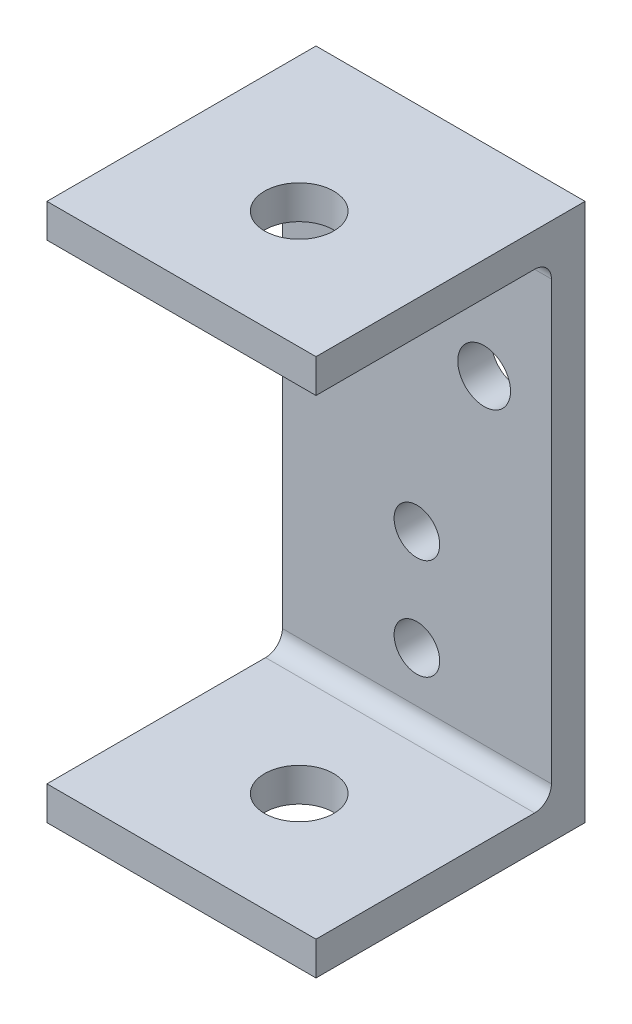
ISO-10303-21;
HEADER;
FILE_DESCRIPTION(('STEP AP214'),'2;1');
FILE_NAME('part.step','',(''),(''),'','','');
FILE_SCHEMA(('AUTOMOTIVE_DESIGN { 1 0 10303 214 1 1 1 1 }'));
ENDSEC;
DATA;
#1=APPLICATION_CONTEXT('core data for automotive mechanical design processes');
#2=APPLICATION_PROTOCOL_DEFINITION('international standard','automotive_design',2000,#1);
#3=PRODUCT_CONTEXT('',#1,'mechanical');
#4=PRODUCT('Part','Part','',(#3));
#5=PRODUCT_RELATED_PRODUCT_CATEGORY('part','',(#4));
#6=PRODUCT_DEFINITION_FORMATION('','',#4);
#7=PRODUCT_DEFINITION_CONTEXT('part definition',#1,'design');
#8=PRODUCT_DEFINITION('design','',#6,#7);
#9=PRODUCT_DEFINITION_SHAPE('','',#8);
#10=(LENGTH_UNIT() NAMED_UNIT(*) SI_UNIT(.MILLI.,.METRE.));
#11=(NAMED_UNIT(*) PLANE_ANGLE_UNIT() SI_UNIT($,.RADIAN.));
#12=(NAMED_UNIT(*) SI_UNIT($,.STERADIAN.) SOLID_ANGLE_UNIT());
#13=UNCERTAINTY_MEASURE_WITH_UNIT(LENGTH_MEASURE(1.E-05),#10,'distance_accuracy_value','');
#14=(GEOMETRIC_REPRESENTATION_CONTEXT(3) GLOBAL_UNCERTAINTY_ASSIGNED_CONTEXT((#13)) GLOBAL_UNIT_ASSIGNED_CONTEXT((#10,
#11,#12)) REPRESENTATION_CONTEXT('',''));
#15=CARTESIAN_POINT('',(0.,0.,0.));
#16=DIRECTION('',(0.,0.,1.));
#17=DIRECTION('',(1.,0.,0.));
#18=AXIS2_PLACEMENT_3D('',#15,#16,#17);
#19=CARTESIAN_POINT('',(12.7,-50.8,14.2875));
#20=DIRECTION('',(0.,1.,0.));
#21=DIRECTION('',(0.,0.,1.));
#22=AXIS2_PLACEMENT_3D('',#19,#20,#21);
#23=CYLINDRICAL_SURFACE('',#22,3.2639);
#24=CARTESIAN_POINT('',(12.7,-50.8,14.2875));
#25=DIRECTION('',(0.,1.,0.));
#26=DIRECTION('',(0.,0.,1.));
#27=AXIS2_PLACEMENT_3D('',#24,#25,#26);
#28=CIRCLE('',#27,3.2639);
#29=CARTESIAN_POINT('',(12.7,-50.8,17.5514));
#30=VERTEX_POINT('',#29);
#31=EDGE_CURVE('E97',#30,#30,#28,.T.);
#32=ORIENTED_EDGE('',*,*,#31,.F.);
#33=EDGE_LOOP('',(#32));
#34=FACE_BOUND('',#33,.T.);
#35=CARTESIAN_POINT('',(12.7,-47.625,14.2875));
#36=DIRECTION('',(0.,1.,0.));
#37=DIRECTION('',(0.,0.,1.));
#38=AXIS2_PLACEMENT_3D('',#35,#36,#37);
#39=CIRCLE('',#38,3.2639);
#40=CARTESIAN_POINT('',(12.7,-47.625,17.5514));
#41=VERTEX_POINT('',#40);
#42=EDGE_CURVE('E20',#41,#41,#39,.F.);
#43=ORIENTED_EDGE('',*,*,#42,.F.);
#44=EDGE_LOOP('',(#43));
#45=FACE_BOUND('',#44,.T.);
#46=ADVANCED_FACE('F17',(#34,#45),#23,.F.);
#47=CARTESIAN_POINT('',(12.7,-50.8,14.2875));
#48=DIRECTION('',(0.,1.,0.));
#49=DIRECTION('',(0.,0.,1.));
#50=AXIS2_PLACEMENT_3D('',#47,#48,#49);
#51=CYLINDRICAL_SURFACE('',#50,3.2639);
#52=CARTESIAN_POINT('',(12.7,0.,14.2875));
#53=DIRECTION('',(0.,1.,0.));
#54=DIRECTION('',(0.,0.,1.));
#55=AXIS2_PLACEMENT_3D('',#52,#53,#54);
#56=CIRCLE('',#55,3.2639);
#57=CARTESIAN_POINT('',(12.7,0.,17.5514));
#58=VERTEX_POINT('',#57);
#59=EDGE_CURVE('E141',#58,#58,#56,.F.);
#60=ORIENTED_EDGE('',*,*,#59,.F.);
#61=EDGE_LOOP('',(#60));
#62=FACE_BOUND('',#61,.T.);
#63=CARTESIAN_POINT('',(12.7,-3.175,14.2875));
#64=DIRECTION('',(0.,1.,0.));
#65=DIRECTION('',(0.,0.,1.));
#66=AXIS2_PLACEMENT_3D('',#63,#64,#65);
#67=CIRCLE('',#66,3.2639);
#68=CARTESIAN_POINT('',(12.7,-3.175,17.5514));
#69=VERTEX_POINT('',#68);
#70=EDGE_CURVE('E122',#69,#69,#67,.T.);
#71=ORIENTED_EDGE('',*,*,#70,.F.);
#72=EDGE_LOOP('',(#71));
#73=FACE_BOUND('',#72,.T.);
#74=ADVANCED_FACE('F224',(#62,#73),#51,.F.);
#75=CARTESIAN_POINT('',(12.7,-4.7625,4.7625));
#76=DIRECTION('',(1.,0.,0.));
#77=DIRECTION('',(0.,0.,-1.));
#78=AXIS2_PLACEMENT_3D('',#75,#76,#77);
#79=CYLINDRICAL_SURFACE('',#78,1.5875);
#80=CARTESIAN_POINT('',(25.4,-4.7625,4.7625));
#81=DIRECTION('',(1.,0.,0.));
#82=DIRECTION('',(0.,0.,-1.));
#83=AXIS2_PLACEMENT_3D('',#80,#81,#82);
#84=CIRCLE('',#83,1.5875);
#85=CARTESIAN_POINT('',(25.4,-3.175,4.7625));
#86=VERTEX_POINT('',#85);
#87=CARTESIAN_POINT('',(25.4,-4.7625,3.175));
#88=VERTEX_POINT('',#87);
#89=EDGE_CURVE('E213',#86,#88,#84,.F.);
#90=ORIENTED_EDGE('',*,*,#89,.F.);
#91=DIRECTION('',(1.,0.,0.));
#92=VECTOR('',#91,1.);
#93=CARTESIAN_POINT('',(0.,-3.175,4.7625));
#94=LINE('',#93,#92);
#95=CARTESIAN_POINT('',(0.,-3.175,4.7625));
#96=VERTEX_POINT('',#95);
#97=EDGE_CURVE('E85',#96,#86,#94,.T.);
#98=ORIENTED_EDGE('',*,*,#97,.F.);
#99=CARTESIAN_POINT('',(0.,-4.7625,4.7625));
#100=DIRECTION('',(1.,0.,0.));
#101=DIRECTION('',(0.,0.,-1.));
#102=AXIS2_PLACEMENT_3D('',#99,#100,#101);
#103=CIRCLE('',#102,1.5875);
#104=CARTESIAN_POINT('',(0.,-4.7625,3.175));
#105=VERTEX_POINT('',#104);
#106=EDGE_CURVE('E88',#96,#105,#103,.F.);
#107=ORIENTED_EDGE('',*,*,#106,.T.);
#108=DIRECTION('',(1.,0.,0.));
#109=VECTOR('',#108,1.);
#110=CARTESIAN_POINT('',(0.,-4.7625,3.175));
#111=LINE('',#110,#109);
#112=EDGE_CURVE('E91',#88,#105,#111,.F.);
#113=ORIENTED_EDGE('',*,*,#112,.F.);
#114=EDGE_LOOP('',(#90,#98,#107,#113));
#115=FACE_BOUND('',#114,.T.);
#116=ADVANCED_FACE('F90',(#115),#79,.F.);
#117=CARTESIAN_POINT('',(12.7,-46.0375,4.7625));
#118=DIRECTION('',(1.,0.,0.));
#119=DIRECTION('',(0.,0.,-1.));
#120=AXIS2_PLACEMENT_3D('',#117,#118,#119);
#121=CYLINDRICAL_SURFACE('',#120,1.5875);
#122=CARTESIAN_POINT('',(25.4,-46.0375,4.7625));
#123=DIRECTION('',(1.,0.,0.));
#124=DIRECTION('',(0.,0.,-1.));
#125=AXIS2_PLACEMENT_3D('',#122,#123,#124);
#126=CIRCLE('',#125,1.5875);
#127=CARTESIAN_POINT('',(25.4,-46.0375,3.175));
#128=VERTEX_POINT('',#127);
#129=CARTESIAN_POINT('',(25.4,-47.625,4.7625));
#130=VERTEX_POINT('',#129);
#131=EDGE_CURVE('E210',#128,#130,#126,.F.);
#132=ORIENTED_EDGE('',*,*,#131,.F.);
#133=DIRECTION('',(1.,0.,0.));
#134=VECTOR('',#133,1.);
#135=CARTESIAN_POINT('',(0.,-46.0375,3.175));
#136=LINE('',#135,#134);
#137=CARTESIAN_POINT('',(0.,-46.0375,3.175));
#138=VERTEX_POINT('',#137);
#139=EDGE_CURVE('E107',#138,#128,#136,.T.);
#140=ORIENTED_EDGE('',*,*,#139,.F.);
#141=CARTESIAN_POINT('',(0.,-46.0375,4.7625));
#142=DIRECTION('',(1.,0.,0.));
#143=DIRECTION('',(0.,0.,-1.));
#144=AXIS2_PLACEMENT_3D('',#141,#142,#143);
#145=CIRCLE('',#144,1.5875);
#146=CARTESIAN_POINT('',(0.,-47.625,4.7625));
#147=VERTEX_POINT('',#146);
#148=EDGE_CURVE('E111',#138,#147,#145,.F.);
#149=ORIENTED_EDGE('',*,*,#148,.T.);
#150=DIRECTION('',(1.,0.,0.));
#151=VECTOR('',#150,1.);
#152=CARTESIAN_POINT('',(0.,-47.625,4.7625));
#153=LINE('',#152,#151);
#154=EDGE_CURVE('E157',#130,#147,#153,.F.);
#155=ORIENTED_EDGE('',*,*,#154,.F.);
#156=EDGE_LOOP('',(#132,#140,#149,#155));
#157=FACE_BOUND('',#156,.T.);
#158=ADVANCED_FACE('F232',(#157),#121,.F.);
#159=CARTESIAN_POINT('',(0.,-47.625,3.175));
#160=DIRECTION('',(0.,1.,0.));
#161=DIRECTION('',(0.,0.,1.));
#162=AXIS2_PLACEMENT_3D('',#159,#160,#161);
#163=PLANE('',#162);
#164=ORIENTED_EDGE('',*,*,#42,.T.);
#165=EDGE_LOOP('',(#164));
#166=FACE_BOUND('',#165,.T.);
#167=DIRECTION('',(0.,0.,-1.));
#168=VECTOR('',#167,1.);
#169=CARTESIAN_POINT('',(25.4,-47.625,0.));
#170=LINE('',#169,#168);
#171=CARTESIAN_POINT('',(25.4,-47.625,25.4));
#172=VERTEX_POINT('',#171);
#173=EDGE_CURVE('E163',#130,#172,#170,.F.);
#174=ORIENTED_EDGE('',*,*,#173,.F.);
#175=ORIENTED_EDGE('',*,*,#154,.T.);
#176=DIRECTION('',(0.,0.,-1.));
#177=VECTOR('',#176,1.);
#178=CARTESIAN_POINT('',(0.,-47.625,0.));
#179=LINE('',#178,#177);
#180=CARTESIAN_POINT('',(0.,-47.625,25.4));
#181=VERTEX_POINT('',#180);
#182=EDGE_CURVE('E113',#147,#181,#179,.F.);
#183=ORIENTED_EDGE('',*,*,#182,.T.);
#184=DIRECTION('',(1.,0.,0.));
#185=VECTOR('',#184,1.);
#186=CARTESIAN_POINT('',(0.,-47.625,25.4));
#187=LINE('',#186,#185);
#188=EDGE_CURVE('E126',#172,#181,#187,.F.);
#189=ORIENTED_EDGE('',*,*,#188,.F.);
#190=EDGE_LOOP('',(#174,#175,#183,#189));
#191=FACE_BOUND('',#190,.T.);
#192=ADVANCED_FACE('F286',(#166,#191),#163,.T.);
#193=CARTESIAN_POINT('',(0.,0.,25.4));
#194=DIRECTION('',(0.,0.,1.));
#195=DIRECTION('',(1.,0.,0.));
#196=AXIS2_PLACEMENT_3D('',#193,#194,#195);
#197=PLANE('',#196);
#198=DIRECTION('',(1.,0.,0.));
#199=VECTOR('',#198,1.);
#200=CARTESIAN_POINT('',(0.,-50.8,25.4));
#201=LINE('',#200,#199);
#202=CARTESIAN_POINT('',(25.4,-50.8,25.4));
#203=VERTEX_POINT('',#202);
#204=CARTESIAN_POINT('',(0.,-50.8,25.4));
#205=VERTEX_POINT('',#204);
#206=EDGE_CURVE('E106',#203,#205,#201,.F.);
#207=ORIENTED_EDGE('',*,*,#206,.F.);
#208=DIRECTION('',(0.,1.,0.));
#209=VECTOR('',#208,1.);
#210=CARTESIAN_POINT('',(25.4,0.,25.4));
#211=LINE('',#210,#209);
#212=EDGE_CURVE('E160',#172,#203,#211,.F.);
#213=ORIENTED_EDGE('',*,*,#212,.F.);
#214=ORIENTED_EDGE('',*,*,#188,.T.);
#215=DIRECTION('',(0.,1.,0.));
#216=VECTOR('',#215,1.);
#217=CARTESIAN_POINT('',(0.,0.,25.4));
#218=LINE('',#217,#216);
#219=EDGE_CURVE('E186',#181,#205,#218,.F.);
#220=ORIENTED_EDGE('',*,*,#219,.T.);
#221=EDGE_LOOP('',(#207,#213,#214,#220));
#222=FACE_BOUND('',#221,.T.);
#223=ADVANCED_FACE('F282',(#222),#197,.T.);
#224=CARTESIAN_POINT('',(0.,0.,25.4));
#225=DIRECTION('',(0.,0.,1.));
#226=DIRECTION('',(1.,0.,0.));
#227=AXIS2_PLACEMENT_3D('',#224,#225,#226);
#228=PLANE('',#227);
#229=DIRECTION('',(1.,0.,0.));
#230=VECTOR('',#229,1.);
#231=CARTESIAN_POINT('',(0.,-3.175,25.4));
#232=LINE('',#231,#230);
#233=CARTESIAN_POINT('',(25.4,-3.175,25.4));
#234=VERTEX_POINT('',#233);
#235=CARTESIAN_POINT('',(0.,-3.175,25.4));
#236=VERTEX_POINT('',#235);
#237=EDGE_CURVE('E123',#234,#236,#232,.F.);
#238=ORIENTED_EDGE('',*,*,#237,.F.);
#239=DIRECTION('',(0.,1.,0.));
#240=VECTOR('',#239,1.);
#241=CARTESIAN_POINT('',(25.4,0.,25.4));
#242=LINE('',#241,#240);
#243=CARTESIAN_POINT('',(25.4,0.,25.4));
#244=VERTEX_POINT('',#243);
#245=EDGE_CURVE('E129',#244,#234,#242,.F.);
#246=ORIENTED_EDGE('',*,*,#245,.F.);
#247=DIRECTION('',(1.,0.,0.));
#248=VECTOR('',#247,1.);
#249=CARTESIAN_POINT('',(0.,0.,25.4));
#250=LINE('',#249,#248);
#251=CARTESIAN_POINT('',(0.,0.,25.4));
#252=VERTEX_POINT('',#251);
#253=EDGE_CURVE('E139',#252,#244,#250,.T.);
#254=ORIENTED_EDGE('',*,*,#253,.F.);
#255=DIRECTION('',(0.,1.,0.));
#256=VECTOR('',#255,1.);
#257=CARTESIAN_POINT('',(0.,0.,25.4));
#258=LINE('',#257,#256);
#259=EDGE_CURVE('E176',#252,#236,#258,.F.);
#260=ORIENTED_EDGE('',*,*,#259,.T.);
#261=EDGE_LOOP('',(#238,#246,#254,#260));
#262=FACE_BOUND('',#261,.T.);
#263=ADVANCED_FACE('F279',(#262),#228,.T.);
#264=CARTESIAN_POINT('',(0.,-3.175,25.4));
#265=DIRECTION('',(0.,-1.,0.));
#266=DIRECTION('',(0.,0.,-1.));
#267=AXIS2_PLACEMENT_3D('',#264,#265,#266);
#268=PLANE('',#267);
#269=ORIENTED_EDGE('',*,*,#70,.T.);
#270=EDGE_LOOP('',(#269));
#271=FACE_BOUND('',#270,.T.);
#272=DIRECTION('',(0.,0.,-1.));
#273=VECTOR('',#272,1.);
#274=CARTESIAN_POINT('',(0.,-3.175,0.));
#275=LINE('',#274,#273);
#276=EDGE_CURVE('E173',#236,#96,#275,.T.);
#277=ORIENTED_EDGE('',*,*,#276,.T.);
#278=ORIENTED_EDGE('',*,*,#97,.T.);
#279=DIRECTION('',(0.,0.,-1.));
#280=VECTOR('',#279,1.);
#281=CARTESIAN_POINT('',(25.4,-3.175,0.));
#282=LINE('',#281,#280);
#283=EDGE_CURVE('E132',#234,#86,#282,.T.);
#284=ORIENTED_EDGE('',*,*,#283,.F.);
#285=ORIENTED_EDGE('',*,*,#237,.T.);
#286=EDGE_LOOP('',(#277,#278,#284,#285));
#287=FACE_BOUND('',#286,.T.);
#288=ADVANCED_FACE('F221',(#271,#287),#268,.T.);
#289=CARTESIAN_POINT('',(0.,-3.175,3.175));
#290=DIRECTION('',(0.,0.,1.));
#291=DIRECTION('',(1.,0.,0.));
#292=AXIS2_PLACEMENT_3D('',#289,#290,#291);
#293=PLANE('',#292);
#294=CARTESIAN_POINT('',(12.7,-41.275,3.175));
#295=DIRECTION('',(0.,0.,1.));
#296=DIRECTION('',(1.,0.,0.));
#297=AXIS2_PLACEMENT_3D('',#294,#295,#296);
#298=CIRCLE('',#297,2.15265);
#299=CARTESIAN_POINT('',(14.85265,-41.275,3.175));
#300=VERTEX_POINT('',#299);
#301=EDGE_CURVE('E198',#300,#300,#298,.F.);
#302=ORIENTED_EDGE('',*,*,#301,.T.);
#303=EDGE_LOOP('',(#302));
#304=FACE_BOUND('',#303,.T.);
#305=CARTESIAN_POINT('',(12.7,-31.75,3.175));
#306=DIRECTION('',(0.,0.,1.));
#307=DIRECTION('',(1.,0.,0.));
#308=AXIS2_PLACEMENT_3D('',#305,#306,#307);
#309=CIRCLE('',#308,2.15265);
#310=CARTESIAN_POINT('',(14.85265,-31.75,3.175));
#311=VERTEX_POINT('',#310);
#312=EDGE_CURVE('E201',#311,#311,#309,.F.);
#313=ORIENTED_EDGE('',*,*,#312,.T.);
#314=EDGE_LOOP('',(#313));
#315=FACE_BOUND('',#314,.T.);
#316=CARTESIAN_POINT('',(19.05,-15.875,3.175));
#317=DIRECTION('',(0.,0.,1.));
#318=DIRECTION('',(1.,0.,0.));
#319=AXIS2_PLACEMENT_3D('',#316,#317,#318);
#320=CIRCLE('',#319,2.4892);
#321=CARTESIAN_POINT('',(21.5392,-15.875,3.175));
#322=VERTEX_POINT('',#321);
#323=EDGE_CURVE('E204',#322,#322,#320,.F.);
#324=ORIENTED_EDGE('',*,*,#323,.T.);
#325=EDGE_LOOP('',(#324));
#326=FACE_BOUND('',#325,.T.);
#327=CARTESIAN_POINT('',(6.35,-15.875,3.175));
#328=DIRECTION('',(0.,0.,1.));
#329=DIRECTION('',(1.,0.,0.));
#330=AXIS2_PLACEMENT_3D('',#327,#328,#329);
#331=CIRCLE('',#330,2.4892);
#332=CARTESIAN_POINT('',(8.8392,-15.875,3.175));
#333=VERTEX_POINT('',#332);
#334=EDGE_CURVE('E207',#333,#333,#331,.F.);
#335=ORIENTED_EDGE('',*,*,#334,.T.);
#336=EDGE_LOOP('',(#335));
#337=FACE_BOUND('',#336,.T.);
#338=DIRECTION('',(0.,1.,0.));
#339=VECTOR('',#338,1.);
#340=CARTESIAN_POINT('',(25.4,0.,3.175));
#341=LINE('',#340,#339);
#342=EDGE_CURVE('E104',#88,#128,#341,.F.);
#343=ORIENTED_EDGE('',*,*,#342,.F.);
#344=ORIENTED_EDGE('',*,*,#112,.T.);
#345=DIRECTION('',(0.,1.,0.));
#346=VECTOR('',#345,1.);
#347=CARTESIAN_POINT('',(0.,0.,3.175));
#348=LINE('',#347,#346);
#349=EDGE_CURVE('E96',#105,#138,#348,.F.);
#350=ORIENTED_EDGE('',*,*,#349,.T.);
#351=ORIENTED_EDGE('',*,*,#139,.T.);
#352=EDGE_LOOP('',(#343,#344,#350,#351));
#353=FACE_BOUND('',#352,.T.);
#354=ADVANCED_FACE('F101',(#304,#315,#326,#337,#353),#293,.T.);
#355=CARTESIAN_POINT('',(0.,-50.8,25.4));
#356=DIRECTION('',(0.,-1.,0.));
#357=DIRECTION('',(0.,0.,-1.));
#358=AXIS2_PLACEMENT_3D('',#355,#356,#357);
#359=PLANE('',#358);
#360=ORIENTED_EDGE('',*,*,#31,.T.);
#361=EDGE_LOOP('',(#360));
#362=FACE_BOUND('',#361,.T.);
#363=DIRECTION('',(-1.,0.,0.));
#364=VECTOR('',#363,1.);
#365=CARTESIAN_POINT('',(0.,-50.8,0.));
#366=LINE('',#365,#364);
#367=CARTESIAN_POINT('',(25.4,-50.8,0.));
#368=VERTEX_POINT('',#367);
#369=CARTESIAN_POINT('',(0.,-50.8,0.));
#370=VERTEX_POINT('',#369);
#371=EDGE_CURVE('E183',#368,#370,#366,.T.);
#372=ORIENTED_EDGE('',*,*,#371,.F.);
#373=DIRECTION('',(0.,0.,-1.));
#374=VECTOR('',#373,1.);
#375=CARTESIAN_POINT('',(25.4,-50.8,0.));
#376=LINE('',#375,#374);
#377=EDGE_CURVE('E136',#203,#368,#376,.T.);
#378=ORIENTED_EDGE('',*,*,#377,.F.);
#379=ORIENTED_EDGE('',*,*,#206,.T.);
#380=DIRECTION('',(0.,0.,-1.));
#381=VECTOR('',#380,1.);
#382=CARTESIAN_POINT('',(0.,-50.8,0.));
#383=LINE('',#382,#381);
#384=EDGE_CURVE('E178',#205,#370,#383,.T.);
#385=ORIENTED_EDGE('',*,*,#384,.T.);
#386=EDGE_LOOP('',(#372,#378,#379,#385));
#387=FACE_BOUND('',#386,.T.);
#388=ADVANCED_FACE('F270',(#362,#387),#359,.T.);
#389=CARTESIAN_POINT('',(0.,0.,0.));
#390=DIRECTION('',(1.,0.,0.));
#391=DIRECTION('',(0.,0.,-1.));
#392=AXIS2_PLACEMENT_3D('',#389,#390,#391);
#393=PLANE('',#392);
#394=ORIENTED_EDGE('',*,*,#259,.F.);
#395=DIRECTION('',(0.,0.,1.));
#396=VECTOR('',#395,1.);
#397=CARTESIAN_POINT('',(0.,0.,0.));
#398=LINE('',#397,#396);
#399=CARTESIAN_POINT('',(0.,0.,0.));
#400=VERTEX_POINT('',#399);
#401=EDGE_CURVE('E142',#400,#252,#398,.T.);
#402=ORIENTED_EDGE('',*,*,#401,.F.);
#403=DIRECTION('',(0.,1.,0.));
#404=VECTOR('',#403,1.);
#405=CARTESIAN_POINT('',(0.,-50.8,0.));
#406=LINE('',#405,#404);
#407=EDGE_CURVE('E154',#370,#400,#406,.T.);
#408=ORIENTED_EDGE('',*,*,#407,.F.);
#409=ORIENTED_EDGE('',*,*,#384,.F.);
#410=ORIENTED_EDGE('',*,*,#219,.F.);
#411=ORIENTED_EDGE('',*,*,#182,.F.);
#412=ORIENTED_EDGE('',*,*,#148,.F.);
#413=ORIENTED_EDGE('',*,*,#349,.F.);
#414=ORIENTED_EDGE('',*,*,#106,.F.);
#415=ORIENTED_EDGE('',*,*,#276,.F.);
#416=EDGE_LOOP('',(#394,#402,#408,#409,#410,#411,#412,#413,#414,#415));
#417=FACE_BOUND('',#416,.T.);
#418=ADVANCED_FACE('F109',(#417),#393,.F.);
#419=CARTESIAN_POINT('',(0.,0.,0.));
#420=DIRECTION('',(0.,1.,0.));
#421=DIRECTION('',(0.,0.,1.));
#422=AXIS2_PLACEMENT_3D('',#419,#420,#421);
#423=PLANE('',#422);
#424=ORIENTED_EDGE('',*,*,#59,.T.);
#425=EDGE_LOOP('',(#424));
#426=FACE_BOUND('',#425,.T.);
#427=ORIENTED_EDGE('',*,*,#253,.T.);
#428=DIRECTION('',(0.,0.,-1.));
#429=VECTOR('',#428,1.);
#430=CARTESIAN_POINT('',(25.4,0.,0.));
#431=LINE('',#430,#429);
#432=CARTESIAN_POINT('',(25.4,0.,0.));
#433=VERTEX_POINT('',#432);
#434=EDGE_CURVE('E35',#433,#244,#431,.F.);
#435=ORIENTED_EDGE('',*,*,#434,.F.);
#436=DIRECTION('',(-1.,0.,0.));
#437=VECTOR('',#436,1.);
#438=CARTESIAN_POINT('',(0.,0.,0.));
#439=LINE('',#438,#437);
#440=EDGE_CURVE('E149',#400,#433,#439,.F.);
#441=ORIENTED_EDGE('',*,*,#440,.F.);
#442=ORIENTED_EDGE('',*,*,#401,.T.);
#443=EDGE_LOOP('',(#427,#435,#441,#442));
#444=FACE_BOUND('',#443,.T.);
#445=ADVANCED_FACE('F263',(#426,#444),#423,.T.);
#446=CARTESIAN_POINT('',(25.4,0.,0.));
#447=DIRECTION('',(1.,0.,0.));
#448=DIRECTION('',(0.,0.,-1.));
#449=AXIS2_PLACEMENT_3D('',#446,#447,#448);
#450=PLANE('',#449);
#451=ORIENTED_EDGE('',*,*,#245,.T.);
#452=ORIENTED_EDGE('',*,*,#283,.T.);
#453=ORIENTED_EDGE('',*,*,#89,.T.);
#454=ORIENTED_EDGE('',*,*,#342,.T.);
#455=ORIENTED_EDGE('',*,*,#131,.T.);
#456=ORIENTED_EDGE('',*,*,#173,.T.);
#457=ORIENTED_EDGE('',*,*,#212,.T.);
#458=ORIENTED_EDGE('',*,*,#377,.T.);
#459=DIRECTION('',(0.,1.,0.));
#460=VECTOR('',#459,1.);
#461=CARTESIAN_POINT('',(25.4,-50.8,0.));
#462=LINE('',#461,#460);
#463=EDGE_CURVE('E145',#433,#368,#462,.F.);
#464=ORIENTED_EDGE('',*,*,#463,.F.);
#465=ORIENTED_EDGE('',*,*,#434,.T.);
#466=EDGE_LOOP('',(#451,#452,#453,#454,#455,#456,#457,#458,#464,#465));
#467=FACE_BOUND('',#466,.T.);
#468=ADVANCED_FACE('F259',(#467),#450,.T.);
#469=CARTESIAN_POINT('',(6.35,-15.875,0.927499999826));
#470=DIRECTION('',(0.,0.,1.));
#471=DIRECTION('',(1.,0.,0.));
#472=AXIS2_PLACEMENT_3D('',#469,#470,#471);
#473=CYLINDRICAL_SURFACE('',#472,2.4892);
#474=ORIENTED_EDGE('',*,*,#334,.F.);
#475=EDGE_LOOP('',(#474));
#476=FACE_BOUND('',#475,.T.);
#477=CARTESIAN_POINT('',(6.35,-15.875,0.));
#478=DIRECTION('',(0.,0.,1.));
#479=DIRECTION('',(1.,0.,0.));
#480=AXIS2_PLACEMENT_3D('',#477,#478,#479);
#481=CIRCLE('',#480,2.4892);
#482=CARTESIAN_POINT('',(8.8392,-15.875,0.));
#483=VERTEX_POINT('',#482);
#484=EDGE_CURVE('E148',#483,#483,#481,.T.);
#485=ORIENTED_EDGE('',*,*,#484,.F.);
#486=EDGE_LOOP('',(#485));
#487=FACE_BOUND('',#486,.T.);
#488=ADVANCED_FACE('F255',(#476,#487),#473,.F.);
#489=CARTESIAN_POINT('',(19.05,-15.875,0.927499999826));
#490=DIRECTION('',(0.,0.,1.));
#491=DIRECTION('',(1.,0.,0.));
#492=AXIS2_PLACEMENT_3D('',#489,#490,#491);
#493=CYLINDRICAL_SURFACE('',#492,2.4892);
#494=ORIENTED_EDGE('',*,*,#323,.F.);
#495=EDGE_LOOP('',(#494));
#496=FACE_BOUND('',#495,.T.);
#497=CARTESIAN_POINT('',(19.05,-15.875,0.));
#498=DIRECTION('',(0.,0.,1.));
#499=DIRECTION('',(1.,0.,0.));
#500=AXIS2_PLACEMENT_3D('',#497,#498,#499);
#501=CIRCLE('',#500,2.4892);
#502=CARTESIAN_POINT('',(21.5392,-15.875,0.));
#503=VERTEX_POINT('',#502);
#504=EDGE_CURVE('E193',#503,#503,#501,.T.);
#505=ORIENTED_EDGE('',*,*,#504,.F.);
#506=EDGE_LOOP('',(#505));
#507=FACE_BOUND('',#506,.T.);
#508=ADVANCED_FACE('F251',(#496,#507),#493,.F.);
#509=CARTESIAN_POINT('',(12.7,-31.75,0.927499999826));
#510=DIRECTION('',(0.,0.,1.));
#511=DIRECTION('',(1.,0.,0.));
#512=AXIS2_PLACEMENT_3D('',#509,#510,#511);
#513=CYLINDRICAL_SURFACE('',#512,2.15265);
#514=ORIENTED_EDGE('',*,*,#312,.F.);
#515=EDGE_LOOP('',(#514));
#516=FACE_BOUND('',#515,.T.);
#517=CARTESIAN_POINT('',(12.7,-31.75,0.));
#518=DIRECTION('',(0.,0.,1.));
#519=DIRECTION('',(1.,0.,0.));
#520=AXIS2_PLACEMENT_3D('',#517,#518,#519);
#521=CIRCLE('',#520,2.15265);
#522=CARTESIAN_POINT('',(14.85265,-31.75,0.));
#523=VERTEX_POINT('',#522);
#524=EDGE_CURVE('E26',#523,#523,#521,.T.);
#525=ORIENTED_EDGE('',*,*,#524,.F.);
#526=EDGE_LOOP('',(#525));
#527=FACE_BOUND('',#526,.T.);
#528=ADVANCED_FACE('F244',(#516,#527),#513,.F.);
#529=CARTESIAN_POINT('',(12.7,-41.275,0.927499999826));
#530=DIRECTION('',(0.,0.,1.));
#531=DIRECTION('',(1.,0.,0.));
#532=AXIS2_PLACEMENT_3D('',#529,#530,#531);
#533=CYLINDRICAL_SURFACE('',#532,2.15265);
#534=ORIENTED_EDGE('',*,*,#301,.F.);
#535=EDGE_LOOP('',(#534));
#536=FACE_BOUND('',#535,.T.);
#537=CARTESIAN_POINT('',(12.7,-41.275,0.));
#538=DIRECTION('',(0.,0.,1.));
#539=DIRECTION('',(1.,0.,0.));
#540=AXIS2_PLACEMENT_3D('',#537,#538,#539);
#541=CIRCLE('',#540,2.15265);
#542=CARTESIAN_POINT('',(14.85265,-41.275,0.));
#543=VERTEX_POINT('',#542);
#544=EDGE_CURVE('E11',#543,#543,#541,.T.);
#545=ORIENTED_EDGE('',*,*,#544,.F.);
#546=EDGE_LOOP('',(#545));
#547=FACE_BOUND('',#546,.T.);
#548=ADVANCED_FACE('F238',(#536,#547),#533,.F.);
#549=CARTESIAN_POINT('',(0.,-50.8,0.));
#550=DIRECTION('',(0.,0.,-1.));
#551=DIRECTION('',(-1.,0.,0.));
#552=AXIS2_PLACEMENT_3D('',#549,#550,#551);
#553=PLANE('',#552);
#554=ORIENTED_EDGE('',*,*,#544,.T.);
#555=EDGE_LOOP('',(#554));
#556=FACE_BOUND('',#555,.T.);
#557=ORIENTED_EDGE('',*,*,#524,.T.);
#558=EDGE_LOOP('',(#557));
#559=FACE_BOUND('',#558,.T.);
#560=ORIENTED_EDGE('',*,*,#504,.T.);
#561=EDGE_LOOP('',(#560));
#562=FACE_BOUND('',#561,.T.);
#563=ORIENTED_EDGE('',*,*,#484,.T.);
#564=EDGE_LOOP('',(#563));
#565=FACE_BOUND('',#564,.T.);
#566=ORIENTED_EDGE('',*,*,#440,.T.);
#567=ORIENTED_EDGE('',*,*,#463,.T.);
#568=ORIENTED_EDGE('',*,*,#371,.T.);
#569=ORIENTED_EDGE('',*,*,#407,.T.);
#570=EDGE_LOOP('',(#566,#567,#568,#569));
#571=FACE_BOUND('',#570,.T.);
#572=ADVANCED_FACE('F236',(#556,#559,#562,#565,#571),#553,.T.);
#573=CLOSED_SHELL('',(#46,#74,#116,#158,#192,#223,#263,#288,#354,#388,#418,#445,#468,#488,#508,
#528,#548,#572));
#574=MANIFOLD_SOLID_BREP('B1',#573);
#575=ADVANCED_BREP_SHAPE_REPRESENTATION('',(#18,#574),#14);
#576=SHAPE_DEFINITION_REPRESENTATION(#9,#575);
ENDSEC;
END-ISO-10303-21;
